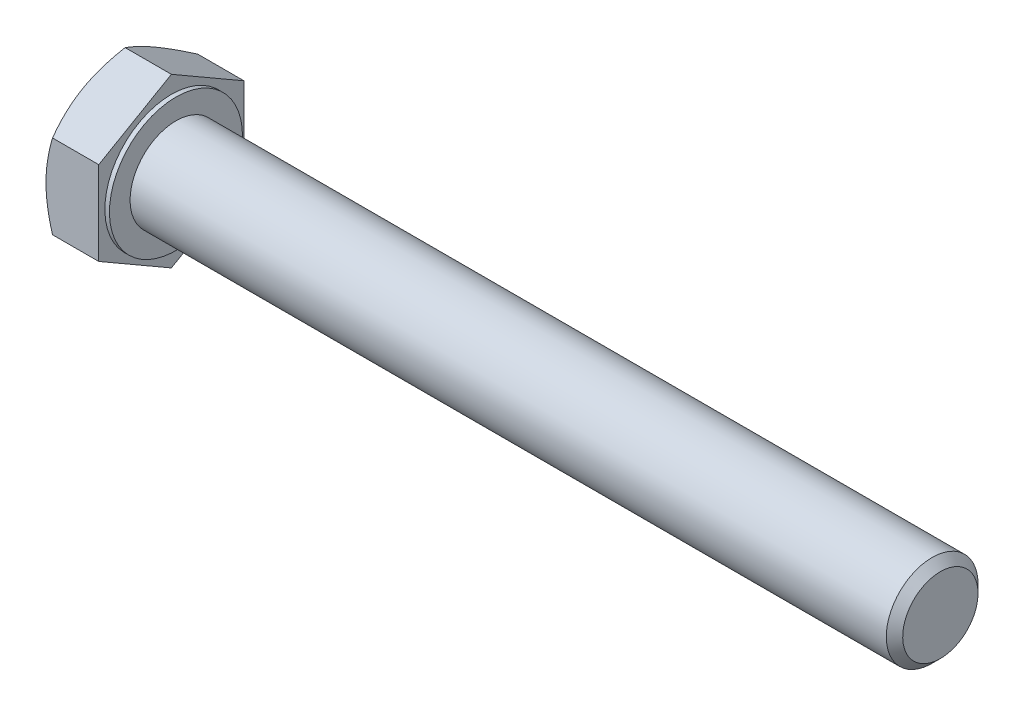
ISO-10303-21;
HEADER;
FILE_DESCRIPTION(('STEP AP214'),'2;1');
FILE_NAME('part.step','',(''),(''),'','','');
FILE_SCHEMA(('AUTOMOTIVE_DESIGN { 1 0 10303 214 1 1 1 1 }'));
ENDSEC;
DATA;
#1=APPLICATION_CONTEXT('core data for automotive mechanical design processes');
#2=APPLICATION_PROTOCOL_DEFINITION('international standard','automotive_design',2000,#1);
#3=PRODUCT_CONTEXT('',#1,'mechanical');
#4=PRODUCT('Part','Part','',(#3));
#5=PRODUCT_RELATED_PRODUCT_CATEGORY('part','',(#4));
#6=PRODUCT_DEFINITION_FORMATION('','',#4);
#7=PRODUCT_DEFINITION_CONTEXT('part definition',#1,'design');
#8=PRODUCT_DEFINITION('design','',#6,#7);
#9=PRODUCT_DEFINITION_SHAPE('','',#8);
#10=(LENGTH_UNIT() NAMED_UNIT(*) SI_UNIT(.MILLI.,.METRE.));
#11=(NAMED_UNIT(*) PLANE_ANGLE_UNIT() SI_UNIT($,.RADIAN.));
#12=(NAMED_UNIT(*) SI_UNIT($,.STERADIAN.) SOLID_ANGLE_UNIT());
#13=UNCERTAINTY_MEASURE_WITH_UNIT(LENGTH_MEASURE(1.E-05),#10,'distance_accuracy_value','');
#14=(GEOMETRIC_REPRESENTATION_CONTEXT(3) GLOBAL_UNCERTAINTY_ASSIGNED_CONTEXT((#13)) GLOBAL_UNIT_ASSIGNED_CONTEXT((#10,
#11,#12)) REPRESENTATION_CONTEXT('',''));
#15=CARTESIAN_POINT('',(0.,0.,0.));
#16=DIRECTION('',(0.,0.,1.));
#17=DIRECTION('',(1.,0.,0.));
#18=AXIS2_PLACEMENT_3D('',#15,#16,#17);
#19=CARTESIAN_POINT('',(99.46318125,0.,0.));
#20=DIRECTION('',(-1.,0.,0.));
#21=DIRECTION('',(0.,1.,0.));
#22=AXIS2_PLACEMENT_3D('',#19,#20,#21);
#23=CONICAL_SURFACE('',#22,5.46323125000001,0.785351590575055);
#24=CARTESIAN_POINT('',(98.9263625,0.,0.));
#25=DIRECTION('',(1.,0.,0.));
#26=DIRECTION('',(0.,1.,0.));
#27=AXIS2_PLACEMENT_3D('',#24,#25,#26);
#28=CIRCLE('',#27,6.00000000000001);
#29=CARTESIAN_POINT('',(98.9263625,6.00000000000002,0.));
#30=VERTEX_POINT('',#29);
#31=EDGE_CURVE('E10',#30,#30,#28,.T.);
#32=ORIENTED_EDGE('',*,*,#31,.T.);
#33=EDGE_LOOP('',(#32));
#34=FACE_BOUND('',#33,.T.);
#35=CARTESIAN_POINT('',(100.,0.,0.));
#36=DIRECTION('',(-1.,0.,0.));
#37=DIRECTION('',(0.,1.,0.));
#38=AXIS2_PLACEMENT_3D('',#35,#36,#37);
#39=CIRCLE('',#38,4.92646250000001);
#40=CARTESIAN_POINT('',(100.,4.92646250000002,0.));
#41=VERTEX_POINT('',#40);
#42=EDGE_CURVE('E26',#41,#41,#39,.T.);
#43=ORIENTED_EDGE('',*,*,#42,.T.);
#44=EDGE_LOOP('',(#43));
#45=FACE_BOUND('',#44,.T.);
#46=ADVANCED_FACE('F16',(#34,#45),#23,.T.);
#47=CARTESIAN_POINT('',(85.,0.,0.));
#48=DIRECTION('',(1.,0.,0.));
#49=DIRECTION('',(0.,1.,0.));
#50=AXIS2_PLACEMENT_3D('',#47,#48,#49);
#51=CYLINDRICAL_SURFACE('',#50,6.00000000000001);
#52=CARTESIAN_POINT('',(0.,0.,0.));
#53=DIRECTION('',(1.,0.,0.));
#54=DIRECTION('',(0.,1.,0.));
#55=AXIS2_PLACEMENT_3D('',#52,#53,#54);
#56=CIRCLE('',#55,6.);
#57=CARTESIAN_POINT('',(0.,6.,0.));
#58=VERTEX_POINT('',#57);
#59=EDGE_CURVE('E165',#58,#58,#56,.T.);
#60=ORIENTED_EDGE('',*,*,#59,.T.);
#61=EDGE_LOOP('',(#60));
#62=FACE_BOUND('',#61,.T.);
#63=ORIENTED_EDGE('',*,*,#31,.F.);
#64=EDGE_LOOP('',(#63));
#65=FACE_BOUND('',#64,.T.);
#66=ADVANCED_FACE('F251',(#62,#65),#51,.T.);
#67=CARTESIAN_POINT('',(100.,3.00000000000002,0.));
#68=DIRECTION('',(1.,0.,0.));
#69=DIRECTION('',(0.,1.,0.));
#70=AXIS2_PLACEMENT_3D('',#67,#68,#69);
#71=PLANE('',#70);
#72=ORIENTED_EDGE('',*,*,#42,.F.);
#73=EDGE_LOOP('',(#72));
#74=FACE_BOUND('',#73,.T.);
#75=ADVANCED_FACE('F248',(#74),#71,.T.);
#76=CARTESIAN_POINT('',(-7.07584711198407,0.,0.));
#77=DIRECTION('',(1.,0.,0.));
#78=DIRECTION('',(0.,0.,1.));
#79=AXIS2_PLACEMENT_3D('',#76,#77,#78);
#80=CONICAL_SURFACE('',#79,10.2348275573014,1.0471975511966);
#81=CARTESIAN_POINT('',(-7.50010000000001,8.22724133595216,4.75));
#82=CARTESIAN_POINT('',(-7.50010000000002,6.95448267190434,6.95448267190431));
#83=CARTESIAN_POINT('',(-6.65159422396813,5.48482755730145,9.49999999999997));
#84=(BOUNDED_CURVE() B_SPLINE_CURVE(2,(#81,#82,#83),.UNSPECIFIED.,.F.,
.F.) B_SPLINE_CURVE_WITH_KNOTS((3,3),(0.556424232836477,1.11284846567295),
.UNSPECIFIED.) CURVE() GEOMETRIC_REPRESENTATION_ITEM() RATIONAL_B_SPLINE_CURVE((1.,
1.03795484930205,1.)) REPRESENTATION_ITEM(''));
#85=CARTESIAN_POINT('',(-7.50010000000001,8.22724133595216,4.75));
#86=VERTEX_POINT('',#85);
#87=CARTESIAN_POINT('',(-6.65159422396813,5.48482755730141,9.5));
#88=VERTEX_POINT('',#87);
#89=EDGE_CURVE('E140',#86,#88,#84,.T.);
#90=ORIENTED_EDGE('',*,*,#89,.F.);
#91=CARTESIAN_POINT('',(-7.50009999999999,0.,0.));
#92=DIRECTION('',(-1.,0.,0.));
#93=DIRECTION('',(0.,1.,0.));
#94=AXIS2_PLACEMENT_3D('',#91,#92,#93);
#95=CIRCLE('',#94,9.50000000000003);
#96=CARTESIAN_POINT('',(-7.50010000000001,0.,9.49999999999999));
#97=VERTEX_POINT('',#96);
#98=EDGE_CURVE('E118',#97,#86,#95,.T.);
#99=ORIENTED_EDGE('',*,*,#98,.F.);
#100=CARTESIAN_POINT('',(-6.65159422396813,5.4848275573014,9.5));
#101=CARTESIAN_POINT('',(-7.50010000000002,2.54551732809564,9.49999999999999));
#102=CARTESIAN_POINT('',(-7.50010000000001,0.,9.49999999999999));
#103=(BOUNDED_CURVE() B_SPLINE_CURVE(2,(#100,#101,#102),.UNSPECIFIED.,.F.,
.F.) B_SPLINE_CURVE_WITH_KNOTS((3,3),(0.,0.556424232836477),
.UNSPECIFIED.) CURVE() GEOMETRIC_REPRESENTATION_ITEM() RATIONAL_B_SPLINE_CURVE((1.,
1.03795484930203,1.)) REPRESENTATION_ITEM(''));
#104=EDGE_CURVE('E135',#88,#97,#103,.T.);
#105=ORIENTED_EDGE('',*,*,#104,.F.);
#106=EDGE_LOOP('',(#90,#99,#105));
#107=FACE_BOUND('',#106,.T.);
#108=ADVANCED_FACE('F250',(#107),#80,.T.);
#109=CARTESIAN_POINT('',(-7.07584711198407,0.,0.));
#110=DIRECTION('',(1.,0.,0.));
#111=DIRECTION('',(0.,0.,1.));
#112=AXIS2_PLACEMENT_3D('',#109,#110,#111);
#113=CONICAL_SURFACE('',#112,10.2348275573014,1.0471975511966);
#114=CARTESIAN_POINT('',(-6.65159422396813,-5.48482755730146,9.49999999999997));
#115=CARTESIAN_POINT('',(-7.50010000000002,-6.95448267190434,6.95448267190432));
#116=CARTESIAN_POINT('',(-7.50010000000001,-8.22724133595216,4.74999999999999));
#117=(BOUNDED_CURVE() B_SPLINE_CURVE(2,(#114,#115,#116),.UNSPECIFIED.,.F.,
.F.) B_SPLINE_CURVE_WITH_KNOTS((3,3),(0.,0.556424232836478),
.UNSPECIFIED.) CURVE() GEOMETRIC_REPRESENTATION_ITEM() RATIONAL_B_SPLINE_CURVE((1.,
1.03795484930202,1.)) REPRESENTATION_ITEM(''));
#118=CARTESIAN_POINT('',(-6.65159422396813,-5.48482755730142,9.49999999999999));
#119=VERTEX_POINT('',#118);
#120=CARTESIAN_POINT('',(-7.50010000000001,-8.22724133595216,4.74999999999999));
#121=VERTEX_POINT('',#120);
#122=EDGE_CURVE('E116',#119,#121,#117,.T.);
#123=ORIENTED_EDGE('',*,*,#122,.F.);
#124=CARTESIAN_POINT('',(-7.50010000000001,0.,9.49999999999999));
#125=CARTESIAN_POINT('',(-7.50010000000002,-2.54551732809565,9.49999999999999));
#126=CARTESIAN_POINT('',(-6.65159422396813,-5.48482755730142,9.49999999999999));
#127=(BOUNDED_CURVE() B_SPLINE_CURVE(2,(#124,#125,#126),.UNSPECIFIED.,.F.,
.F.) B_SPLINE_CURVE_WITH_KNOTS((3,3),(0.556424232836477,1.11284846567295),
.UNSPECIFIED.) CURVE() GEOMETRIC_REPRESENTATION_ITEM() RATIONAL_B_SPLINE_CURVE((1.,
1.03795484930204,1.)) REPRESENTATION_ITEM(''));
#128=EDGE_CURVE('E134',#97,#119,#127,.T.);
#129=ORIENTED_EDGE('',*,*,#128,.F.);
#130=CARTESIAN_POINT('',(-7.50009999999999,0.,0.));
#131=DIRECTION('',(-1.,0.,0.));
#132=DIRECTION('',(0.,1.,0.));
#133=AXIS2_PLACEMENT_3D('',#130,#131,#132);
#134=CIRCLE('',#133,9.50000000000003);
#135=EDGE_CURVE('E125',#121,#97,#134,.T.);
#136=ORIENTED_EDGE('',*,*,#135,.F.);
#137=EDGE_LOOP('',(#123,#129,#136));
#138=FACE_BOUND('',#137,.T.);
#139=ADVANCED_FACE('F258',(#138),#113,.T.);
#140=CARTESIAN_POINT('',(-7.07584711198407,0.,0.));
#141=DIRECTION('',(1.,0.,0.));
#142=DIRECTION('',(0.,0.,1.));
#143=AXIS2_PLACEMENT_3D('',#140,#141,#142);
#144=CONICAL_SURFACE('',#143,10.2348275573014,1.0471975511966);
#145=CARTESIAN_POINT('',(-7.50010000000001,8.22724133595216,-4.74999999999999));
#146=CARTESIAN_POINT('',(-7.50010000000001,9.49999999999999,-2.54551732809567));
#147=CARTESIAN_POINT('',(-6.65159422396814,10.9696551146029,0.));
#148=(BOUNDED_CURVE() B_SPLINE_CURVE(2,(#145,#146,#147),.UNSPECIFIED.,.F.,
.F.) B_SPLINE_CURVE_WITH_KNOTS((3,3),(0.556424232836478,1.11284846567296),
.UNSPECIFIED.) CURVE() GEOMETRIC_REPRESENTATION_ITEM() RATIONAL_B_SPLINE_CURVE((1.,
1.03795484930205,1.)) REPRESENTATION_ITEM(''));
#149=CARTESIAN_POINT('',(-7.50010000000001,8.22724133595216,-4.74999999999999));
#150=VERTEX_POINT('',#149);
#151=CARTESIAN_POINT('',(-6.65159422396813,10.9696551146029,0.));
#152=VERTEX_POINT('',#151);
#153=EDGE_CURVE('E148',#150,#152,#148,.T.);
#154=ORIENTED_EDGE('',*,*,#153,.F.);
#155=CARTESIAN_POINT('',(-7.50009999999999,0.,0.));
#156=DIRECTION('',(-1.,0.,0.));
#157=DIRECTION('',(0.,1.,0.));
#158=AXIS2_PLACEMENT_3D('',#155,#156,#157);
#159=CIRCLE('',#158,9.50000000000003);
#160=EDGE_CURVE('E35',#86,#150,#159,.T.);
#161=ORIENTED_EDGE('',*,*,#160,.F.);
#162=CARTESIAN_POINT('',(-6.65159422396813,10.9696551146029,0.));
#163=CARTESIAN_POINT('',(-7.50010000000002,9.49999999999998,2.54551732809569));
#164=CARTESIAN_POINT('',(-7.50010000000001,8.22724133595216,4.75));
#165=(BOUNDED_CURVE() B_SPLINE_CURVE(2,(#162,#163,#164),.UNSPECIFIED.,.F.,
.F.) B_SPLINE_CURVE_WITH_KNOTS((3,3),(0.,0.556424232836477),
.UNSPECIFIED.) CURVE() GEOMETRIC_REPRESENTATION_ITEM() RATIONAL_B_SPLINE_CURVE((1.,
1.03795484930204,1.)) REPRESENTATION_ITEM(''));
#166=EDGE_CURVE('E149',#152,#86,#165,.T.);
#167=ORIENTED_EDGE('',*,*,#166,.F.);
#168=EDGE_LOOP('',(#154,#161,#167));
#169=FACE_BOUND('',#168,.T.);
#170=ADVANCED_FACE('F271',(#169),#144,.T.);
#171=CARTESIAN_POINT('',(-7.07584711198407,0.,0.));
#172=DIRECTION('',(1.,0.,0.));
#173=DIRECTION('',(0.,0.,1.));
#174=AXIS2_PLACEMENT_3D('',#171,#172,#173);
#175=CONICAL_SURFACE('',#174,10.2348275573014,1.0471975511966);
#176=CARTESIAN_POINT('',(-6.65159422396814,-10.9696551146029,0.));
#177=CARTESIAN_POINT('',(-7.50010000000002,-9.49999999999998,-2.54551732809569));
#178=CARTESIAN_POINT('',(-7.50010000000001,-8.22724133595216,-4.75));
#179=(BOUNDED_CURVE() B_SPLINE_CURVE(2,(#176,#177,#178),.UNSPECIFIED.,.F.,
.F.) B_SPLINE_CURVE_WITH_KNOTS((3,3),(0.,0.556424232836477),
.UNSPECIFIED.) CURVE() GEOMETRIC_REPRESENTATION_ITEM() RATIONAL_B_SPLINE_CURVE((1.,
1.03795484930204,1.)) REPRESENTATION_ITEM(''));
#180=CARTESIAN_POINT('',(-6.65159422396813,-10.9696551146029,0.));
#181=VERTEX_POINT('',#180);
#182=CARTESIAN_POINT('',(-7.50010000000001,-8.22724133595216,-4.75));
#183=VERTEX_POINT('',#182);
#184=EDGE_CURVE('E115',#181,#183,#179,.T.);
#185=ORIENTED_EDGE('',*,*,#184,.F.);
#186=CARTESIAN_POINT('',(-7.50010000000001,-8.22724133595216,4.74999999999999));
#187=CARTESIAN_POINT('',(-7.50010000000001,-9.49999999999999,2.54551732809566));
#188=CARTESIAN_POINT('',(-6.65159422396813,-10.9696551146029,0.));
#189=(BOUNDED_CURVE() B_SPLINE_CURVE(2,(#186,#187,#188),.UNSPECIFIED.,.F.,
.F.) B_SPLINE_CURVE_WITH_KNOTS((3,3),(0.556424232836478,1.11284846567296),
.UNSPECIFIED.) CURVE() GEOMETRIC_REPRESENTATION_ITEM() RATIONAL_B_SPLINE_CURVE((1.,
1.03795484930204,1.)) REPRESENTATION_ITEM(''));
#190=EDGE_CURVE('E113',#121,#181,#189,.T.);
#191=ORIENTED_EDGE('',*,*,#190,.F.);
#192=CARTESIAN_POINT('',(-7.50009999999999,0.,0.));
#193=DIRECTION('',(-1.,0.,0.));
#194=DIRECTION('',(0.,1.,0.));
#195=AXIS2_PLACEMENT_3D('',#192,#193,#194);
#196=CIRCLE('',#195,9.50000000000003);
#197=EDGE_CURVE('E153',#183,#121,#196,.T.);
#198=ORIENTED_EDGE('',*,*,#197,.F.);
#199=EDGE_LOOP('',(#185,#191,#198));
#200=FACE_BOUND('',#199,.T.);
#201=ADVANCED_FACE('F274',(#200),#175,.T.);
#202=CARTESIAN_POINT('',(-7.07584711198407,0.,0.));
#203=DIRECTION('',(1.,0.,0.));
#204=DIRECTION('',(0.,0.,1.));
#205=AXIS2_PLACEMENT_3D('',#202,#203,#204);
#206=CONICAL_SURFACE('',#205,10.2348275573014,1.0471975511966);
#207=CARTESIAN_POINT('',(-7.50010000000001,0.,-9.49999999999999));
#208=CARTESIAN_POINT('',(-7.50010000000001,2.54551732809565,-9.49999999999999));
#209=CARTESIAN_POINT('',(-6.65159422396813,5.48482755730141,-9.49999999999999));
#210=(BOUNDED_CURVE() B_SPLINE_CURVE(2,(#207,#208,#209),.UNSPECIFIED.,.F.,
.F.) B_SPLINE_CURVE_WITH_KNOTS((3,3),(0.556424232836477,1.11284846567295),
.UNSPECIFIED.) CURVE() GEOMETRIC_REPRESENTATION_ITEM() RATIONAL_B_SPLINE_CURVE((1.,
1.03795484930205,1.)) REPRESENTATION_ITEM(''));
#211=CARTESIAN_POINT('',(-7.50010000000001,0.,-9.49999999999999));
#212=VERTEX_POINT('',#211);
#213=CARTESIAN_POINT('',(-6.65159422396813,5.48482755730141,-9.49999999999999));
#214=VERTEX_POINT('',#213);
#215=EDGE_CURVE('E142',#212,#214,#210,.T.);
#216=ORIENTED_EDGE('',*,*,#215,.F.);
#217=CARTESIAN_POINT('',(-7.50009999999999,0.,0.));
#218=DIRECTION('',(-1.,0.,0.));
#219=DIRECTION('',(0.,1.,0.));
#220=AXIS2_PLACEMENT_3D('',#217,#218,#219);
#221=CIRCLE('',#220,9.50000000000003);
#222=EDGE_CURVE('E152',#150,#212,#221,.T.);
#223=ORIENTED_EDGE('',*,*,#222,.F.);
#224=CARTESIAN_POINT('',(-6.65159422396813,5.48482755730145,-9.49999999999997));
#225=CARTESIAN_POINT('',(-7.50010000000002,6.95448267190434,-6.95448267190432));
#226=CARTESIAN_POINT('',(-7.50010000000001,8.22724133595216,-4.74999999999999));
#227=(BOUNDED_CURVE() B_SPLINE_CURVE(2,(#224,#225,#226),.UNSPECIFIED.,.F.,
.F.) B_SPLINE_CURVE_WITH_KNOTS((3,3),(0.,0.556424232836478),
.UNSPECIFIED.) CURVE() GEOMETRIC_REPRESENTATION_ITEM() RATIONAL_B_SPLINE_CURVE((1.,
1.03795484930204,1.)) REPRESENTATION_ITEM(''));
#228=EDGE_CURVE('E143',#214,#150,#227,.T.);
#229=ORIENTED_EDGE('',*,*,#228,.F.);
#230=EDGE_LOOP('',(#216,#223,#229));
#231=FACE_BOUND('',#230,.T.);
#232=ADVANCED_FACE('F280',(#231),#206,.T.);
#233=CARTESIAN_POINT('',(-7.07584711198407,0.,0.));
#234=DIRECTION('',(1.,0.,0.));
#235=DIRECTION('',(0.,0.,1.));
#236=AXIS2_PLACEMENT_3D('',#233,#234,#235);
#237=CONICAL_SURFACE('',#236,10.2348275573014,1.0471975511966);
#238=CARTESIAN_POINT('',(-6.65159422396813,-5.48482755730141,-9.5));
#239=CARTESIAN_POINT('',(-7.50010000000001,-2.54551732809564,-9.49999999999999));
#240=CARTESIAN_POINT('',(-7.50010000000001,0.,-9.49999999999999));
#241=(BOUNDED_CURVE() B_SPLINE_CURVE(2,(#238,#239,#240),.UNSPECIFIED.,.F.,
.F.) B_SPLINE_CURVE_WITH_KNOTS((3,3),(0.,0.556424232836477),
.UNSPECIFIED.) CURVE() GEOMETRIC_REPRESENTATION_ITEM() RATIONAL_B_SPLINE_CURVE((1.,
1.03795484930205,1.)) REPRESENTATION_ITEM(''));
#242=CARTESIAN_POINT('',(-6.65159422396813,-5.48482755730145,-9.49999999999997));
#243=VERTEX_POINT('',#242);
#244=EDGE_CURVE('E157',#243,#212,#241,.T.);
#245=ORIENTED_EDGE('',*,*,#244,.F.);
#246=CARTESIAN_POINT('',(-7.50010000000001,-8.22724133595216,-4.75));
#247=CARTESIAN_POINT('',(-7.50010000000002,-6.95448267190434,-6.95448267190431));
#248=CARTESIAN_POINT('',(-6.65159422396814,-5.48482755730146,-9.49999999999996));
#249=(BOUNDED_CURVE() B_SPLINE_CURVE(2,(#246,#247,#248),.UNSPECIFIED.,.F.,
.F.) B_SPLINE_CURVE_WITH_KNOTS((3,3),(0.556424232836477,1.11284846567295),
.UNSPECIFIED.) CURVE() GEOMETRIC_REPRESENTATION_ITEM() RATIONAL_B_SPLINE_CURVE((1.,
1.03795484930204,1.)) REPRESENTATION_ITEM(''));
#250=EDGE_CURVE('E114',#183,#243,#249,.T.);
#251=ORIENTED_EDGE('',*,*,#250,.F.);
#252=CARTESIAN_POINT('',(-7.50009999999999,0.,0.));
#253=DIRECTION('',(-1.,0.,0.));
#254=DIRECTION('',(0.,1.,0.));
#255=AXIS2_PLACEMENT_3D('',#252,#253,#254);
#256=CIRCLE('',#255,9.50000000000003);
#257=EDGE_CURVE('E150',#212,#183,#256,.T.);
#258=ORIENTED_EDGE('',*,*,#257,.F.);
#259=EDGE_LOOP('',(#245,#251,#258));
#260=FACE_BOUND('',#259,.T.);
#261=ADVANCED_FACE('F283',(#260),#237,.T.);
#262=CARTESIAN_POINT('',(-0.600099999999994,-5.48482755730144,-9.49999999999999));
#263=DIRECTION('',(0.,0.,-1.));
#264=DIRECTION('',(0.,1.,0.));
#265=AXIS2_PLACEMENT_3D('',#262,#263,#264);
#266=PLANE('',#265);
#267=ORIENTED_EDGE('',*,*,#244,.T.);
#268=ORIENTED_EDGE('',*,*,#215,.T.);
#269=DIRECTION('',(-1.,0.,0.));
#270=VECTOR('',#269,1.);
#271=CARTESIAN_POINT('',(-0.600099999999995,5.48482755730144,-9.49999999999999));
#272=LINE('',#271,#270);
#273=CARTESIAN_POINT('',(-0.600099999999995,5.48482755730144,-9.49999999999999));
#274=VERTEX_POINT('',#273);
#275=EDGE_CURVE('E145',#274,#214,#272,.T.);
#276=ORIENTED_EDGE('',*,*,#275,.F.);
#277=DIRECTION('',(0.,1.,0.));
#278=VECTOR('',#277,1.);
#279=CARTESIAN_POINT('',(-0.600099999999994,-5.48482755730144,-9.49999999999999));
#280=LINE('',#279,#278);
#281=CARTESIAN_POINT('',(-0.600099999999994,-5.48482755730144,-9.49999999999999));
#282=VERTEX_POINT('',#281);
#283=EDGE_CURVE('E100',#282,#274,#280,.T.);
#284=ORIENTED_EDGE('',*,*,#283,.F.);
#285=DIRECTION('',(-1.,0.,0.));
#286=VECTOR('',#285,1.);
#287=CARTESIAN_POINT('',(-0.600099999999994,-5.48482755730144,-9.49999999999999));
#288=LINE('',#287,#286);
#289=EDGE_CURVE('E98',#282,#243,#288,.T.);
#290=ORIENTED_EDGE('',*,*,#289,.T.);
#291=EDGE_LOOP('',(#267,#268,#276,#284,#290));
#292=FACE_BOUND('',#291,.T.);
#293=ADVANCED_FACE('F286',(#292),#266,.T.);
#294=CARTESIAN_POINT('',(-0.600099999999995,5.48482755730144,-9.49999999999999));
#295=DIRECTION('',(0.,0.866025403784439,-0.5));
#296=DIRECTION('',(0.,0.5,0.866025403784439));
#297=AXIS2_PLACEMENT_3D('',#294,#295,#296);
#298=PLANE('',#297);
#299=ORIENTED_EDGE('',*,*,#228,.T.);
#300=ORIENTED_EDGE('',*,*,#153,.T.);
#301=DIRECTION('',(-1.,0.,0.));
#302=VECTOR('',#301,1.);
#303=CARTESIAN_POINT('',(-0.600099999999996,10.9696551146029,0.));
#304=LINE('',#303,#302);
#305=CARTESIAN_POINT('',(-0.600099999999996,10.9696551146029,0.));
#306=VERTEX_POINT('',#305);
#307=EDGE_CURVE('E130',#306,#152,#304,.T.);
#308=ORIENTED_EDGE('',*,*,#307,.F.);
#309=DIRECTION('',(0.,0.5,0.866025403784439));
#310=VECTOR('',#309,1.);
#311=CARTESIAN_POINT('',(-0.600099999999995,5.48482755730144,-9.49999999999999));
#312=LINE('',#311,#310);
#313=EDGE_CURVE('E136',#274,#306,#312,.T.);
#314=ORIENTED_EDGE('',*,*,#313,.F.);
#315=ORIENTED_EDGE('',*,*,#275,.T.);
#316=EDGE_LOOP('',(#299,#300,#308,#314,#315));
#317=FACE_BOUND('',#316,.T.);
#318=ADVANCED_FACE('F291',(#317),#298,.T.);
#319=CARTESIAN_POINT('',(-0.600099999999996,10.9696551146029,0.));
#320=DIRECTION('',(0.,0.866025403784438,0.500000000000001));
#321=DIRECTION('',(0.,-0.500000000000001,0.866025403784438));
#322=AXIS2_PLACEMENT_3D('',#319,#320,#321);
#323=PLANE('',#322);
#324=ORIENTED_EDGE('',*,*,#166,.T.);
#325=ORIENTED_EDGE('',*,*,#89,.T.);
#326=DIRECTION('',(-1.,0.,0.));
#327=VECTOR('',#326,1.);
#328=CARTESIAN_POINT('',(-0.600099999999995,5.48482755730144,9.5));
#329=LINE('',#328,#327);
#330=CARTESIAN_POINT('',(-0.600099999999995,5.48482755730144,9.5));
#331=VERTEX_POINT('',#330);
#332=EDGE_CURVE('E131',#331,#88,#329,.T.);
#333=ORIENTED_EDGE('',*,*,#332,.F.);
#334=DIRECTION('',(0.,-0.500000000000001,0.866025403784438));
#335=VECTOR('',#334,1.);
#336=CARTESIAN_POINT('',(-0.600099999999996,10.9696551146029,0.));
#337=LINE('',#336,#335);
#338=EDGE_CURVE('E128',#306,#331,#337,.T.);
#339=ORIENTED_EDGE('',*,*,#338,.F.);
#340=ORIENTED_EDGE('',*,*,#307,.T.);
#341=EDGE_LOOP('',(#324,#325,#333,#339,#340));
#342=FACE_BOUND('',#341,.T.);
#343=ADVANCED_FACE('F302',(#342),#323,.T.);
#344=CARTESIAN_POINT('',(-0.600099999999994,0.,0.));
#345=DIRECTION('',(1.,0.,0.));
#346=DIRECTION('',(0.,1.,0.));
#347=AXIS2_PLACEMENT_3D('',#344,#345,#346);
#348=PLANE('',#347);
#349=ORIENTED_EDGE('',*,*,#338,.T.);
#350=DIRECTION('',(0.,-1.,0.));
#351=VECTOR('',#350,1.);
#352=CARTESIAN_POINT('',(-0.600099999999995,5.48482755730144,9.5));
#353=LINE('',#352,#351);
#354=CARTESIAN_POINT('',(-0.600099999999994,-5.48482755730145,9.49999999999999));
#355=VERTEX_POINT('',#354);
#356=EDGE_CURVE('E106',#331,#355,#353,.T.);
#357=ORIENTED_EDGE('',*,*,#356,.T.);
#358=DIRECTION('',(0.,-0.5,-0.866025403784439));
#359=VECTOR('',#358,1.);
#360=CARTESIAN_POINT('',(-0.600099999999994,-5.48482755730145,9.49999999999999));
#361=LINE('',#360,#359);
#362=CARTESIAN_POINT('',(-0.600099999999993,-10.9696551146029,0.));
#363=VERTEX_POINT('',#362);
#364=EDGE_CURVE('E86',#355,#363,#361,.T.);
#365=ORIENTED_EDGE('',*,*,#364,.T.);
#366=DIRECTION('',(0.,0.5,-0.866025403784438));
#367=VECTOR('',#366,1.);
#368=CARTESIAN_POINT('',(-0.600099999999993,-10.9696551146029,0.));
#369=LINE('',#368,#367);
#370=EDGE_CURVE('E93',#363,#282,#369,.T.);
#371=ORIENTED_EDGE('',*,*,#370,.T.);
#372=ORIENTED_EDGE('',*,*,#283,.T.);
#373=ORIENTED_EDGE('',*,*,#313,.T.);
#374=EDGE_LOOP('',(#349,#357,#365,#371,#372,#373));
#375=FACE_BOUND('',#374,.T.);
#376=CARTESIAN_POINT('',(-0.600100000000001,0.,0.));
#377=DIRECTION('',(1.,0.,0.));
#378=DIRECTION('',(0.,1.,0.));
#379=AXIS2_PLACEMENT_3D('',#376,#377,#378);
#380=CIRCLE('',#379,8.7);
#381=CARTESIAN_POINT('',(-0.600100000000001,8.7,0.));
#382=VERTEX_POINT('',#381);
#383=EDGE_CURVE('E123',#382,#382,#380,.T.);
#384=ORIENTED_EDGE('',*,*,#383,.F.);
#385=EDGE_LOOP('',(#384));
#386=FACE_BOUND('',#385,.T.);
#387=ADVANCED_FACE('F103',(#375,#386),#348,.T.);
#388=CARTESIAN_POINT('',(-0.600099999999995,5.48482755730144,9.5));
#389=DIRECTION('',(0.,0.,1.));
#390=DIRECTION('',(0.,-1.,0.));
#391=AXIS2_PLACEMENT_3D('',#388,#389,#390);
#392=PLANE('',#391);
#393=ORIENTED_EDGE('',*,*,#128,.T.);
#394=DIRECTION('',(-1.,0.,0.));
#395=VECTOR('',#394,1.);
#396=CARTESIAN_POINT('',(-0.600099999999994,-5.48482755730145,9.49999999999999));
#397=LINE('',#396,#395);
#398=EDGE_CURVE('E121',#355,#119,#397,.T.);
#399=ORIENTED_EDGE('',*,*,#398,.F.);
#400=ORIENTED_EDGE('',*,*,#356,.F.);
#401=ORIENTED_EDGE('',*,*,#332,.T.);
#402=ORIENTED_EDGE('',*,*,#104,.T.);
#403=EDGE_LOOP('',(#393,#399,#400,#401,#402));
#404=FACE_BOUND('',#403,.T.);
#405=ADVANCED_FACE('F305',(#404),#392,.T.);
#406=CARTESIAN_POINT('',(-0.600099999999994,-5.48482755730145,9.49999999999999));
#407=DIRECTION('',(0.,-0.866025403784439,0.5));
#408=DIRECTION('',(0.,-0.5,-0.866025403784439));
#409=AXIS2_PLACEMENT_3D('',#406,#407,#408);
#410=PLANE('',#409);
#411=ORIENTED_EDGE('',*,*,#190,.T.);
#412=DIRECTION('',(-1.,0.,0.));
#413=VECTOR('',#412,1.);
#414=CARTESIAN_POINT('',(-0.600099999999993,-10.9696551146029,0.));
#415=LINE('',#414,#413);
#416=EDGE_CURVE('E96',#363,#181,#415,.T.);
#417=ORIENTED_EDGE('',*,*,#416,.F.);
#418=ORIENTED_EDGE('',*,*,#364,.F.);
#419=ORIENTED_EDGE('',*,*,#398,.T.);
#420=ORIENTED_EDGE('',*,*,#122,.T.);
#421=EDGE_LOOP('',(#411,#417,#418,#419,#420));
#422=FACE_BOUND('',#421,.T.);
#423=ADVANCED_FACE('F110',(#422),#410,.T.);
#424=CARTESIAN_POINT('',(-0.600099999999993,-10.9696551146029,0.));
#425=DIRECTION('',(0.,-0.866025403784438,-0.5));
#426=DIRECTION('',(0.,0.5,-0.866025403784438));
#427=AXIS2_PLACEMENT_3D('',#424,#425,#426);
#428=PLANE('',#427);
#429=ORIENTED_EDGE('',*,*,#250,.T.);
#430=ORIENTED_EDGE('',*,*,#289,.F.);
#431=ORIENTED_EDGE('',*,*,#370,.F.);
#432=ORIENTED_EDGE('',*,*,#416,.T.);
#433=ORIENTED_EDGE('',*,*,#184,.T.);
#434=EDGE_LOOP('',(#429,#430,#431,#432,#433));
#435=FACE_BOUND('',#434,.T.);
#436=ADVANCED_FACE('F94',(#435),#428,.T.);
#437=CARTESIAN_POINT('',(-7.50009999999999,0.,0.));
#438=DIRECTION('',(1.,0.,0.));
#439=DIRECTION('',(0.,1.,0.));
#440=AXIS2_PLACEMENT_3D('',#437,#438,#439);
#441=PLANE('',#440);
#442=ORIENTED_EDGE('',*,*,#98,.T.);
#443=ORIENTED_EDGE('',*,*,#160,.T.);
#444=ORIENTED_EDGE('',*,*,#222,.T.);
#445=ORIENTED_EDGE('',*,*,#257,.T.);
#446=ORIENTED_EDGE('',*,*,#197,.T.);
#447=ORIENTED_EDGE('',*,*,#135,.T.);
#448=EDGE_LOOP('',(#442,#443,#444,#445,#446,#447));
#449=FACE_BOUND('',#448,.T.);
#450=ADVANCED_FACE('F308',(#449),#441,.F.);
#451=CARTESIAN_POINT('',(-0.300049999999992,0.,0.));
#452=DIRECTION('',(1.,0.,0.));
#453=DIRECTION('',(0.,1.,0.));
#454=AXIS2_PLACEMENT_3D('',#451,#452,#453);
#455=CYLINDRICAL_SURFACE('',#454,8.7);
#456=CARTESIAN_POINT('',(0.,0.,0.));
#457=DIRECTION('',(1.,0.,0.));
#458=DIRECTION('',(0.,1.,0.));
#459=AXIS2_PLACEMENT_3D('',#456,#457,#458);
#460=CIRCLE('',#459,8.7);
#461=CARTESIAN_POINT('',(0.,8.7,0.));
#462=VERTEX_POINT('',#461);
#463=EDGE_CURVE('E20',#462,#462,#460,.T.);
#464=ORIENTED_EDGE('',*,*,#463,.F.);
#465=EDGE_LOOP('',(#464));
#466=FACE_BOUND('',#465,.T.);
#467=ORIENTED_EDGE('',*,*,#383,.T.);
#468=EDGE_LOOP('',(#467));
#469=FACE_BOUND('',#468,.T.);
#470=ADVANCED_FACE('F18',(#466,#469),#455,.T.);
#471=CARTESIAN_POINT('',(0.,7.35,0.));
#472=DIRECTION('',(1.,0.,0.));
#473=DIRECTION('',(0.,1.,0.));
#474=AXIS2_PLACEMENT_3D('',#471,#472,#473);
#475=PLANE('',#474);
#476=ORIENTED_EDGE('',*,*,#59,.F.);
#477=EDGE_LOOP('',(#476));
#478=FACE_BOUND('',#477,.T.);
#479=ORIENTED_EDGE('',*,*,#463,.T.);
#480=EDGE_LOOP('',(#479));
#481=FACE_BOUND('',#480,.T.);
#482=ADVANCED_FACE('F316',(#478,#481),#475,.T.);
#483=CLOSED_SHELL('',(#46,#66,#75,#108,#139,#170,#201,#232,#261,#293,#318,#343,#387,#405,#423,
#436,#450,#470,#482));
#484=MANIFOLD_SOLID_BREP('B1',#483);
#485=ADVANCED_BREP_SHAPE_REPRESENTATION('',(#18,#484),#14);
#486=SHAPE_DEFINITION_REPRESENTATION(#9,#485);
ENDSEC;
END-ISO-10303-21;
